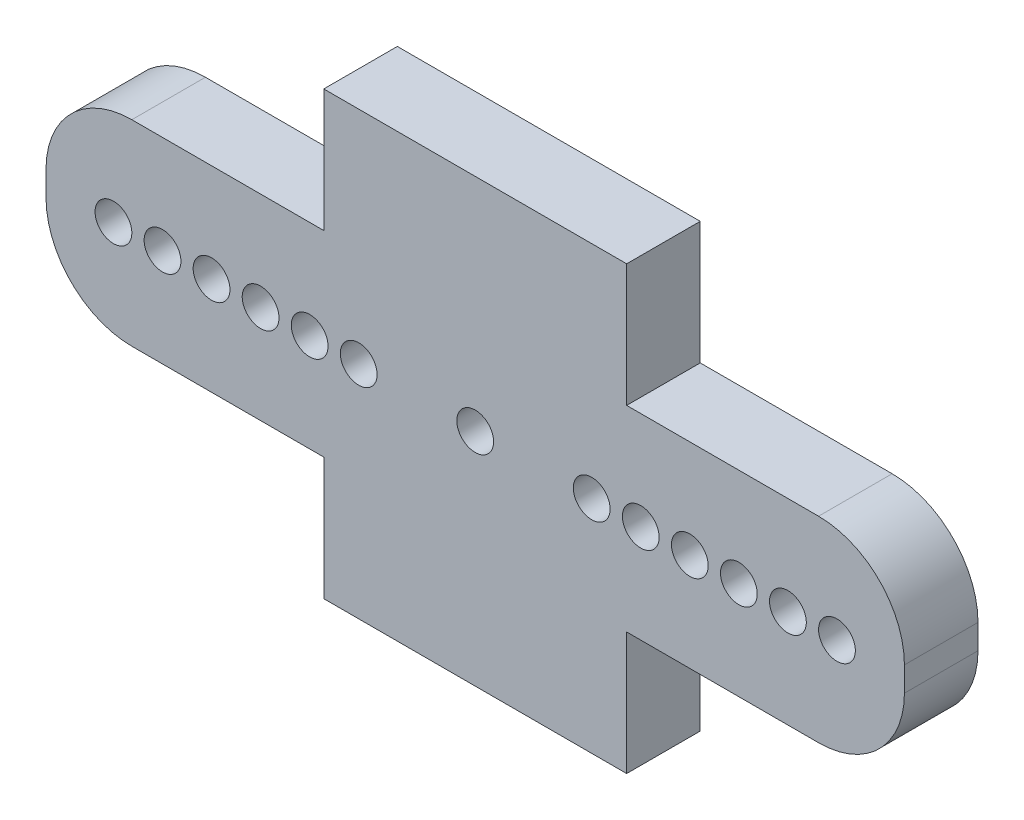
ISO-10303-21;
HEADER;
FILE_DESCRIPTION(('STEP AP214'),'2;1');
FILE_NAME('part.step','',(''),(''),'','','');
FILE_SCHEMA(('AUTOMOTIVE_DESIGN { 1 0 10303 214 1 1 1 1 }'));
ENDSEC;
DATA;
#1=APPLICATION_CONTEXT('core data for automotive mechanical design processes');
#2=APPLICATION_PROTOCOL_DEFINITION('international standard','automotive_design',2000,#1);
#3=PRODUCT_CONTEXT('',#1,'mechanical');
#4=PRODUCT('Part','Part','',(#3));
#5=PRODUCT_RELATED_PRODUCT_CATEGORY('part','',(#4));
#6=PRODUCT_DEFINITION_FORMATION('','',#4);
#7=PRODUCT_DEFINITION_CONTEXT('part definition',#1,'design');
#8=PRODUCT_DEFINITION('design','',#6,#7);
#9=PRODUCT_DEFINITION_SHAPE('','',#8);
#10=(LENGTH_UNIT() NAMED_UNIT(*) SI_UNIT(.MILLI.,.METRE.));
#11=(NAMED_UNIT(*) PLANE_ANGLE_UNIT() SI_UNIT($,.RADIAN.));
#12=(NAMED_UNIT(*) SI_UNIT($,.STERADIAN.) SOLID_ANGLE_UNIT());
#13=UNCERTAINTY_MEASURE_WITH_UNIT(LENGTH_MEASURE(1.E-05),#10,'distance_accuracy_value','');
#14=(GEOMETRIC_REPRESENTATION_CONTEXT(3) GLOBAL_UNCERTAINTY_ASSIGNED_CONTEXT((#13)) GLOBAL_UNIT_ASSIGNED_CONTEXT((#10,
#11,#12)) REPRESENTATION_CONTEXT('',''));
#15=CARTESIAN_POINT('',(0.,0.,0.));
#16=DIRECTION('',(0.,0.,1.));
#17=DIRECTION('',(1.,0.,0.));
#18=AXIS2_PLACEMENT_3D('',#15,#16,#17);
#19=CARTESIAN_POINT('',(-14.,-0.500000000000002,1.5));
#20=DIRECTION('',(0.,0.,-1.));
#21=DIRECTION('',(-1.,0.,0.));
#22=AXIS2_PLACEMENT_3D('',#19,#20,#21);
#23=PLANE('',#22);
#24=CARTESIAN_POINT('',(14.75,0.,1.5));
#25=DIRECTION('',(0.,0.,-1.));
#26=DIRECTION('',(-1.,0.,0.));
#27=AXIS2_PLACEMENT_3D('',#24,#25,#26);
#28=CIRCLE('',#27,0.75);
#29=CARTESIAN_POINT('',(14.,0.,1.5));
#30=VERTEX_POINT('',#29);
#31=EDGE_CURVE('E373',#30,#30,#28,.T.);
#32=ORIENTED_EDGE('',*,*,#31,.T.);
#33=EDGE_LOOP('',(#32));
#34=FACE_BOUND('',#33,.T.);
#35=CARTESIAN_POINT('',(12.75,0.,1.5));
#36=DIRECTION('',(0.,0.,-1.));
#37=DIRECTION('',(-1.,0.,0.));
#38=AXIS2_PLACEMENT_3D('',#35,#36,#37);
#39=CIRCLE('',#38,0.75);
#40=CARTESIAN_POINT('',(12.,0.,1.5));
#41=VERTEX_POINT('',#40);
#42=EDGE_CURVE('E379',#41,#41,#39,.T.);
#43=ORIENTED_EDGE('',*,*,#42,.T.);
#44=EDGE_LOOP('',(#43));
#45=FACE_BOUND('',#44,.T.);
#46=CARTESIAN_POINT('',(10.75,0.,1.5));
#47=DIRECTION('',(0.,0.,-1.));
#48=DIRECTION('',(-1.,0.,0.));
#49=AXIS2_PLACEMENT_3D('',#46,#47,#48);
#50=CIRCLE('',#49,0.75);
#51=CARTESIAN_POINT('',(10.,0.,1.5));
#52=VERTEX_POINT('',#51);
#53=EDGE_CURVE('E387',#52,#52,#50,.T.);
#54=ORIENTED_EDGE('',*,*,#53,.T.);
#55=EDGE_LOOP('',(#54));
#56=FACE_BOUND('',#55,.T.);
#57=CARTESIAN_POINT('',(8.75000000000001,0.,1.5));
#58=DIRECTION('',(0.,0.,-1.));
#59=DIRECTION('',(-1.,0.,0.));
#60=AXIS2_PLACEMENT_3D('',#57,#58,#59);
#61=CIRCLE('',#60,0.75);
#62=CARTESIAN_POINT('',(8.00000000000001,0.,1.5));
#63=VERTEX_POINT('',#62);
#64=EDGE_CURVE('E393',#63,#63,#61,.T.);
#65=ORIENTED_EDGE('',*,*,#64,.T.);
#66=EDGE_LOOP('',(#65));
#67=FACE_BOUND('',#66,.T.);
#68=CARTESIAN_POINT('',(6.75000000000001,0.,1.5));
#69=DIRECTION('',(0.,0.,-1.));
#70=DIRECTION('',(-1.,0.,0.));
#71=AXIS2_PLACEMENT_3D('',#68,#69,#70);
#72=CIRCLE('',#71,0.75);
#73=CARTESIAN_POINT('',(6.00000000000001,0.,1.5));
#74=VERTEX_POINT('',#73);
#75=EDGE_CURVE('E399',#74,#74,#72,.T.);
#76=ORIENTED_EDGE('',*,*,#75,.T.);
#77=EDGE_LOOP('',(#76));
#78=FACE_BOUND('',#77,.T.);
#79=CARTESIAN_POINT('',(4.75000000000001,0.,1.5));
#80=DIRECTION('',(0.,0.,-1.));
#81=DIRECTION('',(-1.,0.,0.));
#82=AXIS2_PLACEMENT_3D('',#79,#80,#81);
#83=CIRCLE('',#82,0.75);
#84=CARTESIAN_POINT('',(4.00000000000001,0.,1.5));
#85=VERTEX_POINT('',#84);
#86=EDGE_CURVE('E405',#85,#85,#83,.T.);
#87=ORIENTED_EDGE('',*,*,#86,.T.);
#88=EDGE_LOOP('',(#87));
#89=FACE_BOUND('',#88,.T.);
#90=CARTESIAN_POINT('',(-14.75,0.,1.5));
#91=DIRECTION('',(0.,0.,1.));
#92=DIRECTION('',(1.,0.,0.));
#93=AXIS2_PLACEMENT_3D('',#90,#91,#92);
#94=CIRCLE('',#93,0.75);
#95=CARTESIAN_POINT('',(-14.,0.,1.5));
#96=VERTEX_POINT('',#95);
#97=EDGE_CURVE('E412',#96,#96,#94,.T.);
#98=ORIENTED_EDGE('',*,*,#97,.F.);
#99=EDGE_LOOP('',(#98));
#100=FACE_BOUND('',#99,.T.);
#101=CARTESIAN_POINT('',(-12.75,0.,1.5));
#102=DIRECTION('',(0.,0.,1.));
#103=DIRECTION('',(1.,0.,0.));
#104=AXIS2_PLACEMENT_3D('',#101,#102,#103);
#105=CIRCLE('',#104,0.75);
#106=CARTESIAN_POINT('',(-12.,0.,1.5));
#107=VERTEX_POINT('',#106);
#108=EDGE_CURVE('E418',#107,#107,#105,.T.);
#109=ORIENTED_EDGE('',*,*,#108,.F.);
#110=EDGE_LOOP('',(#109));
#111=FACE_BOUND('',#110,.T.);
#112=CARTESIAN_POINT('',(-10.75,0.,1.5));
#113=DIRECTION('',(0.,0.,1.));
#114=DIRECTION('',(1.,0.,0.));
#115=AXIS2_PLACEMENT_3D('',#112,#113,#114);
#116=CIRCLE('',#115,0.75);
#117=CARTESIAN_POINT('',(-10.,0.,1.5));
#118=VERTEX_POINT('',#117);
#119=EDGE_CURVE('E424',#118,#118,#116,.T.);
#120=ORIENTED_EDGE('',*,*,#119,.F.);
#121=EDGE_LOOP('',(#120));
#122=FACE_BOUND('',#121,.T.);
#123=CARTESIAN_POINT('',(-8.75000000000001,0.,1.5));
#124=DIRECTION('',(0.,0.,1.));
#125=DIRECTION('',(1.,0.,0.));
#126=AXIS2_PLACEMENT_3D('',#123,#124,#125);
#127=CIRCLE('',#126,0.75);
#128=CARTESIAN_POINT('',(-8.00000000000001,0.,1.5));
#129=VERTEX_POINT('',#128);
#130=EDGE_CURVE('E430',#129,#129,#127,.T.);
#131=ORIENTED_EDGE('',*,*,#130,.F.);
#132=EDGE_LOOP('',(#131));
#133=FACE_BOUND('',#132,.T.);
#134=CARTESIAN_POINT('',(-6.75000000000001,0.,1.5));
#135=DIRECTION('',(0.,0.,1.));
#136=DIRECTION('',(1.,0.,0.));
#137=AXIS2_PLACEMENT_3D('',#134,#135,#136);
#138=CIRCLE('',#137,0.75);
#139=CARTESIAN_POINT('',(-6.00000000000001,0.,1.5));
#140=VERTEX_POINT('',#139);
#141=EDGE_CURVE('E436',#140,#140,#138,.T.);
#142=ORIENTED_EDGE('',*,*,#141,.F.);
#143=EDGE_LOOP('',(#142));
#144=FACE_BOUND('',#143,.T.);
#145=CARTESIAN_POINT('',(-4.75000000000001,0.,1.5));
#146=DIRECTION('',(0.,0.,1.));
#147=DIRECTION('',(1.,0.,0.));
#148=AXIS2_PLACEMENT_3D('',#145,#146,#147);
#149=CIRCLE('',#148,0.75);
#150=CARTESIAN_POINT('',(-4.00000000000001,0.,1.5));
#151=VERTEX_POINT('',#150);
#152=EDGE_CURVE('E376',#151,#151,#149,.T.);
#153=ORIENTED_EDGE('',*,*,#152,.F.);
#154=EDGE_LOOP('',(#153));
#155=FACE_BOUND('',#154,.T.);
#156=DIRECTION('',(1.,0.,0.));
#157=VECTOR('',#156,1.);
#158=CARTESIAN_POINT('',(6.17499999999999,-9.,1.5));
#159=LINE('',#158,#157);
#160=CARTESIAN_POINT('',(-6.17500000000001,-9.,1.5));
#161=VERTEX_POINT('',#160);
#162=CARTESIAN_POINT('',(6.17499999999999,-9.,1.5));
#163=VERTEX_POINT('',#162);
#164=EDGE_CURVE('E209',#161,#163,#159,.T.);
#165=ORIENTED_EDGE('',*,*,#164,.T.);
#166=DIRECTION('',(0.,1.,0.));
#167=VECTOR('',#166,1.);
#168=CARTESIAN_POINT('',(6.17499999999999,-4.,1.5));
#169=LINE('',#168,#167);
#170=CARTESIAN_POINT('',(6.17499999999999,-4.,1.5));
#171=VERTEX_POINT('',#170);
#172=EDGE_CURVE('E117',#163,#171,#169,.T.);
#173=ORIENTED_EDGE('',*,*,#172,.T.);
#174=DIRECTION('',(1.,0.,0.));
#175=VECTOR('',#174,1.);
#176=CARTESIAN_POINT('',(14.,-4.,1.5));
#177=LINE('',#176,#175);
#178=CARTESIAN_POINT('',(14.,-4.,1.5));
#179=VERTEX_POINT('',#178);
#180=EDGE_CURVE('E248',#171,#179,#177,.T.);
#181=ORIENTED_EDGE('',*,*,#180,.T.);
#182=CARTESIAN_POINT('',(14.,-0.500000000000002,1.5));
#183=DIRECTION('',(0.,0.,1.));
#184=DIRECTION('',(-1.,0.,0.));
#185=AXIS2_PLACEMENT_3D('',#182,#183,#184);
#186=CIRCLE('',#185,3.5);
#187=CARTESIAN_POINT('',(17.5,-0.499999999999976,1.5));
#188=VERTEX_POINT('',#187);
#189=EDGE_CURVE('E267',#179,#188,#186,.T.);
#190=ORIENTED_EDGE('',*,*,#189,.T.);
#191=DIRECTION('',(0.,1.,0.));
#192=VECTOR('',#191,1.);
#193=CARTESIAN_POINT('',(17.5,0.499999999999974,1.5));
#194=LINE('',#193,#192);
#195=CARTESIAN_POINT('',(17.5,0.499999999999974,1.5));
#196=VERTEX_POINT('',#195);
#197=EDGE_CURVE('E264',#188,#196,#194,.T.);
#198=ORIENTED_EDGE('',*,*,#197,.T.);
#199=CARTESIAN_POINT('',(14.,0.499999999999998,1.5));
#200=DIRECTION('',(0.,0.,1.));
#201=DIRECTION('',(-1.,0.,0.));
#202=AXIS2_PLACEMENT_3D('',#199,#200,#201);
#203=CIRCLE('',#202,3.5);
#204=CARTESIAN_POINT('',(14.,4.,1.5));
#205=VERTEX_POINT('',#204);
#206=EDGE_CURVE('E266',#196,#205,#203,.T.);
#207=ORIENTED_EDGE('',*,*,#206,.T.);
#208=DIRECTION('',(-1.,0.,0.));
#209=VECTOR('',#208,1.);
#210=CARTESIAN_POINT('',(6.17499999999999,4.,1.5));
#211=LINE('',#210,#209);
#212=CARTESIAN_POINT('',(6.17499999999999,4.,1.5));
#213=VERTEX_POINT('',#212);
#214=EDGE_CURVE('E269',#205,#213,#211,.T.);
#215=ORIENTED_EDGE('',*,*,#214,.T.);
#216=DIRECTION('',(0.,1.,0.));
#217=VECTOR('',#216,1.);
#218=CARTESIAN_POINT('',(6.17499999999999,9.,1.5));
#219=LINE('',#218,#217);
#220=CARTESIAN_POINT('',(6.17499999999999,9.,1.5));
#221=VERTEX_POINT('',#220);
#222=EDGE_CURVE('E275',#213,#221,#219,.T.);
#223=ORIENTED_EDGE('',*,*,#222,.T.);
#224=DIRECTION('',(-1.,0.,0.));
#225=VECTOR('',#224,1.);
#226=CARTESIAN_POINT('',(-6.17500000000001,9.,1.5));
#227=LINE('',#226,#225);
#228=CARTESIAN_POINT('',(-6.17500000000001,9.,1.5));
#229=VERTEX_POINT('',#228);
#230=EDGE_CURVE('E277',#221,#229,#227,.T.);
#231=ORIENTED_EDGE('',*,*,#230,.T.);
#232=DIRECTION('',(0.,-1.,0.));
#233=VECTOR('',#232,1.);
#234=CARTESIAN_POINT('',(-6.17500000000001,4.,1.5));
#235=LINE('',#234,#233);
#236=CARTESIAN_POINT('',(-6.17500000000001,4.,1.5));
#237=VERTEX_POINT('',#236);
#238=EDGE_CURVE('E279',#229,#237,#235,.T.);
#239=ORIENTED_EDGE('',*,*,#238,.T.);
#240=DIRECTION('',(-1.,0.,0.));
#241=VECTOR('',#240,1.);
#242=CARTESIAN_POINT('',(-14.,4.,1.5));
#243=LINE('',#242,#241);
#244=CARTESIAN_POINT('',(-14.,4.,1.5));
#245=VERTEX_POINT('',#244);
#246=EDGE_CURVE('E281',#237,#245,#243,.T.);
#247=ORIENTED_EDGE('',*,*,#246,.T.);
#248=CARTESIAN_POINT('',(-14.,0.499999999999999,1.5));
#249=DIRECTION('',(0.,0.,1.));
#250=DIRECTION('',(1.,0.,0.));
#251=AXIS2_PLACEMENT_3D('',#248,#249,#250);
#252=CIRCLE('',#251,3.5);
#253=CARTESIAN_POINT('',(-17.5,0.499999999999974,1.5));
#254=VERTEX_POINT('',#253);
#255=EDGE_CURVE('E283',#245,#254,#252,.T.);
#256=ORIENTED_EDGE('',*,*,#255,.T.);
#257=DIRECTION('',(0.,-1.,0.));
#258=VECTOR('',#257,1.);
#259=CARTESIAN_POINT('',(-17.5,-0.499999999999977,1.5));
#260=LINE('',#259,#258);
#261=CARTESIAN_POINT('',(-17.5,-0.499999999999977,1.5));
#262=VERTEX_POINT('',#261);
#263=EDGE_CURVE('E160',#254,#262,#260,.T.);
#264=ORIENTED_EDGE('',*,*,#263,.T.);
#265=CARTESIAN_POINT('',(-14.,-0.500000000000002,1.5));
#266=DIRECTION('',(0.,0.,1.));
#267=DIRECTION('',(-1.,0.,0.));
#268=AXIS2_PLACEMENT_3D('',#265,#266,#267);
#269=CIRCLE('',#268,3.5);
#270=CARTESIAN_POINT('',(-14.,-4.,1.5));
#271=VERTEX_POINT('',#270);
#272=EDGE_CURVE('E154',#262,#271,#269,.T.);
#273=ORIENTED_EDGE('',*,*,#272,.T.);
#274=DIRECTION('',(1.,0.,0.));
#275=VECTOR('',#274,1.);
#276=CARTESIAN_POINT('',(-6.17500000000001,-4.,1.5));
#277=LINE('',#276,#275);
#278=CARTESIAN_POINT('',(-6.17500000000001,-4.,1.5));
#279=VERTEX_POINT('',#278);
#280=EDGE_CURVE('E158',#271,#279,#277,.T.);
#281=ORIENTED_EDGE('',*,*,#280,.T.);
#282=DIRECTION('',(0.,-1.,0.));
#283=VECTOR('',#282,1.);
#284=CARTESIAN_POINT('',(-6.17500000000001,-9.,1.5));
#285=LINE('',#284,#283);
#286=EDGE_CURVE('E50',#279,#161,#285,.T.);
#287=ORIENTED_EDGE('',*,*,#286,.T.);
#288=EDGE_LOOP('',(#165,#173,#181,#190,#198,#207,#215,#223,#231,#239,#247,#256,#264,#273,#281,#287));
#289=FACE_BOUND('',#288,.T.);
#290=CARTESIAN_POINT('',(0.,0.,1.5));
#291=DIRECTION('',(0.,0.,1.));
#292=DIRECTION('',(1.,0.,0.));
#293=AXIS2_PLACEMENT_3D('',#290,#291,#292);
#294=CIRCLE('',#293,0.75);
#295=CARTESIAN_POINT('',(0.749999999999993,0.,1.5));
#296=VERTEX_POINT('',#295);
#297=EDGE_CURVE('E182',#296,#296,#294,.T.);
#298=ORIENTED_EDGE('',*,*,#297,.F.);
#299=EDGE_LOOP('',(#298));
#300=FACE_BOUND('',#299,.T.);
#301=ADVANCED_FACE('F33',(#34,#45,#56,#67,#78,#89,#100,#111,#122,#133,#144,#155,#289,#300),#23,.F.);
#302=CARTESIAN_POINT('',(-14.,-0.500000000000002,-1.5));
#303=DIRECTION('',(0.,0.,-1.));
#304=DIRECTION('',(-1.,0.,0.));
#305=AXIS2_PLACEMENT_3D('',#302,#303,#304);
#306=PLANE('',#305);
#307=CARTESIAN_POINT('',(14.75,0.,-1.5));
#308=DIRECTION('',(0.,0.,-1.));
#309=DIRECTION('',(-1.,0.,0.));
#310=AXIS2_PLACEMENT_3D('',#307,#308,#309);
#311=CIRCLE('',#310,0.75);
#312=CARTESIAN_POINT('',(14.,0.,-1.5));
#313=VERTEX_POINT('',#312);
#314=EDGE_CURVE('E371',#313,#313,#311,.T.);
#315=ORIENTED_EDGE('',*,*,#314,.F.);
#316=EDGE_LOOP('',(#315));
#317=FACE_BOUND('',#316,.T.);
#318=CARTESIAN_POINT('',(12.75,0.,-1.5));
#319=DIRECTION('',(0.,0.,-1.));
#320=DIRECTION('',(-1.,0.,0.));
#321=AXIS2_PLACEMENT_3D('',#318,#319,#320);
#322=CIRCLE('',#321,0.75);
#323=CARTESIAN_POINT('',(12.,0.,-1.5));
#324=VERTEX_POINT('',#323);
#325=EDGE_CURVE('E374',#324,#324,#322,.T.);
#326=ORIENTED_EDGE('',*,*,#325,.F.);
#327=EDGE_LOOP('',(#326));
#328=FACE_BOUND('',#327,.T.);
#329=CARTESIAN_POINT('',(10.75,0.,-1.5));
#330=DIRECTION('',(0.,0.,-1.));
#331=DIRECTION('',(-1.,0.,0.));
#332=AXIS2_PLACEMENT_3D('',#329,#330,#331);
#333=CIRCLE('',#332,0.75);
#334=CARTESIAN_POINT('',(10.,0.,-1.5));
#335=VERTEX_POINT('',#334);
#336=EDGE_CURVE('E384',#335,#335,#333,.T.);
#337=ORIENTED_EDGE('',*,*,#336,.F.);
#338=EDGE_LOOP('',(#337));
#339=FACE_BOUND('',#338,.T.);
#340=CARTESIAN_POINT('',(8.75000000000001,0.,-1.5));
#341=DIRECTION('',(0.,0.,-1.));
#342=DIRECTION('',(-1.,0.,0.));
#343=AXIS2_PLACEMENT_3D('',#340,#341,#342);
#344=CIRCLE('',#343,0.75);
#345=CARTESIAN_POINT('',(8.00000000000001,0.,-1.5));
#346=VERTEX_POINT('',#345);
#347=EDGE_CURVE('E390',#346,#346,#344,.T.);
#348=ORIENTED_EDGE('',*,*,#347,.F.);
#349=EDGE_LOOP('',(#348));
#350=FACE_BOUND('',#349,.T.);
#351=CARTESIAN_POINT('',(6.75000000000001,0.,-1.5));
#352=DIRECTION('',(0.,0.,-1.));
#353=DIRECTION('',(-1.,0.,0.));
#354=AXIS2_PLACEMENT_3D('',#351,#352,#353);
#355=CIRCLE('',#354,0.75);
#356=CARTESIAN_POINT('',(6.00000000000001,0.,-1.5));
#357=VERTEX_POINT('',#356);
#358=EDGE_CURVE('E396',#357,#357,#355,.T.);
#359=ORIENTED_EDGE('',*,*,#358,.F.);
#360=EDGE_LOOP('',(#359));
#361=FACE_BOUND('',#360,.T.);
#362=CARTESIAN_POINT('',(4.75000000000001,0.,-1.5));
#363=DIRECTION('',(0.,0.,-1.));
#364=DIRECTION('',(-1.,0.,0.));
#365=AXIS2_PLACEMENT_3D('',#362,#363,#364);
#366=CIRCLE('',#365,0.75);
#367=CARTESIAN_POINT('',(4.00000000000001,0.,-1.5));
#368=VERTEX_POINT('',#367);
#369=EDGE_CURVE('E402',#368,#368,#366,.T.);
#370=ORIENTED_EDGE('',*,*,#369,.F.);
#371=EDGE_LOOP('',(#370));
#372=FACE_BOUND('',#371,.T.);
#373=CARTESIAN_POINT('',(-14.75,0.,-1.5));
#374=DIRECTION('',(0.,0.,1.));
#375=DIRECTION('',(1.,0.,0.));
#376=AXIS2_PLACEMENT_3D('',#373,#374,#375);
#377=CIRCLE('',#376,0.75);
#378=CARTESIAN_POINT('',(-14.,0.,-1.5));
#379=VERTEX_POINT('',#378);
#380=EDGE_CURVE('E408',#379,#379,#377,.T.);
#381=ORIENTED_EDGE('',*,*,#380,.T.);
#382=EDGE_LOOP('',(#381));
#383=FACE_BOUND('',#382,.T.);
#384=CARTESIAN_POINT('',(-12.75,0.,-1.5));
#385=DIRECTION('',(0.,0.,1.));
#386=DIRECTION('',(1.,0.,0.));
#387=AXIS2_PLACEMENT_3D('',#384,#385,#386);
#388=CIRCLE('',#387,0.75);
#389=CARTESIAN_POINT('',(-12.,0.,-1.5));
#390=VERTEX_POINT('',#389);
#391=EDGE_CURVE('E415',#390,#390,#388,.T.);
#392=ORIENTED_EDGE('',*,*,#391,.T.);
#393=EDGE_LOOP('',(#392));
#394=FACE_BOUND('',#393,.T.);
#395=CARTESIAN_POINT('',(-10.75,0.,-1.5));
#396=DIRECTION('',(0.,0.,1.));
#397=DIRECTION('',(1.,0.,0.));
#398=AXIS2_PLACEMENT_3D('',#395,#396,#397);
#399=CIRCLE('',#398,0.75);
#400=CARTESIAN_POINT('',(-10.,0.,-1.5));
#401=VERTEX_POINT('',#400);
#402=EDGE_CURVE('E421',#401,#401,#399,.T.);
#403=ORIENTED_EDGE('',*,*,#402,.T.);
#404=EDGE_LOOP('',(#403));
#405=FACE_BOUND('',#404,.T.);
#406=CARTESIAN_POINT('',(-8.75000000000001,0.,-1.5));
#407=DIRECTION('',(0.,0.,1.));
#408=DIRECTION('',(1.,0.,0.));
#409=AXIS2_PLACEMENT_3D('',#406,#407,#408);
#410=CIRCLE('',#409,0.75);
#411=CARTESIAN_POINT('',(-8.00000000000001,0.,-1.5));
#412=VERTEX_POINT('',#411);
#413=EDGE_CURVE('E427',#412,#412,#410,.T.);
#414=ORIENTED_EDGE('',*,*,#413,.T.);
#415=EDGE_LOOP('',(#414));
#416=FACE_BOUND('',#415,.T.);
#417=CARTESIAN_POINT('',(-6.75000000000001,0.,-1.5));
#418=DIRECTION('',(0.,0.,1.));
#419=DIRECTION('',(1.,0.,0.));
#420=AXIS2_PLACEMENT_3D('',#417,#418,#419);
#421=CIRCLE('',#420,0.75);
#422=CARTESIAN_POINT('',(-6.00000000000001,0.,-1.5));
#423=VERTEX_POINT('',#422);
#424=EDGE_CURVE('E433',#423,#423,#421,.T.);
#425=ORIENTED_EDGE('',*,*,#424,.T.);
#426=EDGE_LOOP('',(#425));
#427=FACE_BOUND('',#426,.T.);
#428=CARTESIAN_POINT('',(-4.75000000000001,0.,-1.5));
#429=DIRECTION('',(0.,0.,1.));
#430=DIRECTION('',(1.,0.,0.));
#431=AXIS2_PLACEMENT_3D('',#428,#429,#430);
#432=CIRCLE('',#431,0.75);
#433=CARTESIAN_POINT('',(-4.00000000000001,0.,-1.5));
#434=VERTEX_POINT('',#433);
#435=EDGE_CURVE('E439',#434,#434,#432,.T.);
#436=ORIENTED_EDGE('',*,*,#435,.T.);
#437=EDGE_LOOP('',(#436));
#438=FACE_BOUND('',#437,.T.);
#439=DIRECTION('',(1.,0.,0.));
#440=VECTOR('',#439,1.);
#441=CARTESIAN_POINT('',(6.17499999999999,-9.,-1.5));
#442=LINE('',#441,#440);
#443=CARTESIAN_POINT('',(-6.17500000000001,-9.,-1.5));
#444=VERTEX_POINT('',#443);
#445=CARTESIAN_POINT('',(6.17499999999999,-9.,-1.5));
#446=VERTEX_POINT('',#445);
#447=EDGE_CURVE('E178',#444,#446,#442,.T.);
#448=ORIENTED_EDGE('',*,*,#447,.F.);
#449=DIRECTION('',(0.,-1.,0.));
#450=VECTOR('',#449,1.);
#451=CARTESIAN_POINT('',(-6.17500000000001,-9.,-1.5));
#452=LINE('',#451,#450);
#453=CARTESIAN_POINT('',(-6.17500000000001,-4.,-1.5));
#454=VERTEX_POINT('',#453);
#455=EDGE_CURVE('E109',#454,#444,#452,.T.);
#456=ORIENTED_EDGE('',*,*,#455,.F.);
#457=DIRECTION('',(1.,0.,0.));
#458=VECTOR('',#457,1.);
#459=CARTESIAN_POINT('',(-6.17500000000001,-4.,-1.5));
#460=LINE('',#459,#458);
#461=CARTESIAN_POINT('',(-14.,-4.,-1.5));
#462=VERTEX_POINT('',#461);
#463=EDGE_CURVE('E103',#462,#454,#460,.T.);
#464=ORIENTED_EDGE('',*,*,#463,.F.);
#465=CARTESIAN_POINT('',(-14.,-0.500000000000002,-1.5));
#466=DIRECTION('',(0.,0.,1.));
#467=DIRECTION('',(-1.,0.,0.));
#468=AXIS2_PLACEMENT_3D('',#465,#466,#467);
#469=CIRCLE('',#468,3.5);
#470=CARTESIAN_POINT('',(-17.5,-0.499999999999977,-1.5));
#471=VERTEX_POINT('',#470);
#472=EDGE_CURVE('E168',#471,#462,#469,.T.);
#473=ORIENTED_EDGE('',*,*,#472,.F.);
#474=DIRECTION('',(0.,-1.,0.));
#475=VECTOR('',#474,1.);
#476=CARTESIAN_POINT('',(-17.5,-0.499999999999977,-1.5));
#477=LINE('',#476,#475);
#478=CARTESIAN_POINT('',(-17.5,0.499999999999974,-1.5));
#479=VERTEX_POINT('',#478);
#480=EDGE_CURVE('E204',#479,#471,#477,.T.);
#481=ORIENTED_EDGE('',*,*,#480,.F.);
#482=CARTESIAN_POINT('',(-14.,0.499999999999999,-1.5));
#483=DIRECTION('',(0.,0.,1.));
#484=DIRECTION('',(1.,0.,0.));
#485=AXIS2_PLACEMENT_3D('',#482,#483,#484);
#486=CIRCLE('',#485,3.5);
#487=CARTESIAN_POINT('',(-14.,4.,-1.5));
#488=VERTEX_POINT('',#487);
#489=EDGE_CURVE('E202',#488,#479,#486,.T.);
#490=ORIENTED_EDGE('',*,*,#489,.F.);
#491=DIRECTION('',(-1.,0.,0.));
#492=VECTOR('',#491,1.);
#493=CARTESIAN_POINT('',(-14.,4.,-1.5));
#494=LINE('',#493,#492);
#495=CARTESIAN_POINT('',(-6.17500000000001,4.,-1.5));
#496=VERTEX_POINT('',#495);
#497=EDGE_CURVE('E200',#496,#488,#494,.T.);
#498=ORIENTED_EDGE('',*,*,#497,.F.);
#499=DIRECTION('',(0.,-1.,0.));
#500=VECTOR('',#499,1.);
#501=CARTESIAN_POINT('',(-6.17500000000001,4.,-1.5));
#502=LINE('',#501,#500);
#503=CARTESIAN_POINT('',(-6.17500000000001,9.,-1.5));
#504=VERTEX_POINT('',#503);
#505=EDGE_CURVE('E198',#504,#496,#502,.T.);
#506=ORIENTED_EDGE('',*,*,#505,.F.);
#507=DIRECTION('',(-1.,0.,0.));
#508=VECTOR('',#507,1.);
#509=CARTESIAN_POINT('',(-6.17500000000001,9.,-1.5));
#510=LINE('',#509,#508);
#511=CARTESIAN_POINT('',(6.17499999999999,9.,-1.5));
#512=VERTEX_POINT('',#511);
#513=EDGE_CURVE('E196',#512,#504,#510,.T.);
#514=ORIENTED_EDGE('',*,*,#513,.F.);
#515=DIRECTION('',(0.,1.,0.));
#516=VECTOR('',#515,1.);
#517=CARTESIAN_POINT('',(6.17499999999999,9.,-1.5));
#518=LINE('',#517,#516);
#519=CARTESIAN_POINT('',(6.17499999999999,4.,-1.5));
#520=VERTEX_POINT('',#519);
#521=EDGE_CURVE('E194',#520,#512,#518,.T.);
#522=ORIENTED_EDGE('',*,*,#521,.F.);
#523=DIRECTION('',(-1.,0.,0.));
#524=VECTOR('',#523,1.);
#525=CARTESIAN_POINT('',(6.17499999999999,4.,-1.5));
#526=LINE('',#525,#524);
#527=CARTESIAN_POINT('',(14.,4.,-1.5));
#528=VERTEX_POINT('',#527);
#529=EDGE_CURVE('E192',#528,#520,#526,.T.);
#530=ORIENTED_EDGE('',*,*,#529,.F.);
#531=CARTESIAN_POINT('',(14.,0.499999999999998,-1.5));
#532=DIRECTION('',(0.,0.,1.));
#533=DIRECTION('',(-1.,0.,0.));
#534=AXIS2_PLACEMENT_3D('',#531,#532,#533);
#535=CIRCLE('',#534,3.5);
#536=CARTESIAN_POINT('',(17.5,0.499999999999974,-1.5));
#537=VERTEX_POINT('',#536);
#538=EDGE_CURVE('E190',#537,#528,#535,.T.);
#539=ORIENTED_EDGE('',*,*,#538,.F.);
#540=DIRECTION('',(0.,1.,0.));
#541=VECTOR('',#540,1.);
#542=CARTESIAN_POINT('',(17.5,0.499999999999974,-1.5));
#543=LINE('',#542,#541);
#544=CARTESIAN_POINT('',(17.5,-0.499999999999976,-1.5));
#545=VERTEX_POINT('',#544);
#546=EDGE_CURVE('E188',#545,#537,#543,.T.);
#547=ORIENTED_EDGE('',*,*,#546,.F.);
#548=CARTESIAN_POINT('',(14.,-0.500000000000002,-1.5));
#549=DIRECTION('',(0.,0.,1.));
#550=DIRECTION('',(-1.,0.,0.));
#551=AXIS2_PLACEMENT_3D('',#548,#549,#550);
#552=CIRCLE('',#551,3.5);
#553=CARTESIAN_POINT('',(14.,-4.,-1.5));
#554=VERTEX_POINT('',#553);
#555=EDGE_CURVE('E186',#554,#545,#552,.T.);
#556=ORIENTED_EDGE('',*,*,#555,.F.);
#557=DIRECTION('',(1.,0.,0.));
#558=VECTOR('',#557,1.);
#559=CARTESIAN_POINT('',(14.,-4.,-1.5));
#560=LINE('',#559,#558);
#561=CARTESIAN_POINT('',(6.17499999999999,-4.,-1.5));
#562=VERTEX_POINT('',#561);
#563=EDGE_CURVE('E184',#562,#554,#560,.T.);
#564=ORIENTED_EDGE('',*,*,#563,.F.);
#565=DIRECTION('',(0.,1.,0.));
#566=VECTOR('',#565,1.);
#567=CARTESIAN_POINT('',(6.17499999999999,-4.,-1.5));
#568=LINE('',#567,#566);
#569=EDGE_CURVE('E181',#446,#562,#568,.T.);
#570=ORIENTED_EDGE('',*,*,#569,.F.);
#571=EDGE_LOOP('',(#448,#456,#464,#473,#481,#490,#498,#506,#514,#522,#530,#539,#547,#556,#564,#570));
#572=FACE_BOUND('',#571,.T.);
#573=CARTESIAN_POINT('',(0.,0.,-1.5));
#574=DIRECTION('',(0.,0.,1.));
#575=DIRECTION('',(1.,0.,0.));
#576=AXIS2_PLACEMENT_3D('',#573,#574,#575);
#577=CIRCLE('',#576,0.75);
#578=CARTESIAN_POINT('',(0.749999999999993,0.,-1.5));
#579=VERTEX_POINT('',#578);
#580=EDGE_CURVE('E411',#579,#579,#577,.T.);
#581=ORIENTED_EDGE('',*,*,#580,.T.);
#582=EDGE_LOOP('',(#581));
#583=FACE_BOUND('',#582,.T.);
#584=ADVANCED_FACE('F252',(#317,#328,#339,#350,#361,#372,#383,#394,#405,#416,#427,#438,#572,
#583),#306,.T.);
#585=CARTESIAN_POINT('',(6.17499999999999,-9.,1.5));
#586=DIRECTION('',(0.,1.,0.));
#587=DIRECTION('',(0.,0.,1.));
#588=AXIS2_PLACEMENT_3D('',#585,#586,#587);
#589=PLANE('',#588);
#590=ORIENTED_EDGE('',*,*,#447,.T.);
#591=DIRECTION('',(0.,0.,-1.));
#592=VECTOR('',#591,1.);
#593=CARTESIAN_POINT('',(6.17499999999999,-9.,1.5));
#594=LINE('',#593,#592);
#595=EDGE_CURVE('E11',#163,#446,#594,.T.);
#596=ORIENTED_EDGE('',*,*,#595,.F.);
#597=ORIENTED_EDGE('',*,*,#164,.F.);
#598=DIRECTION('',(0.,0.,-1.));
#599=VECTOR('',#598,1.);
#600=CARTESIAN_POINT('',(-6.17500000000001,-9.,1.5));
#601=LINE('',#600,#599);
#602=EDGE_CURVE('E174',#161,#444,#601,.T.);
#603=ORIENTED_EDGE('',*,*,#602,.T.);
#604=EDGE_LOOP('',(#590,#596,#597,#603));
#605=FACE_BOUND('',#604,.T.);
#606=ADVANCED_FACE('F35',(#605),#589,.F.);
#607=CARTESIAN_POINT('',(6.17499999999999,-4.,1.5));
#608=DIRECTION('',(-1.,0.,0.));
#609=DIRECTION('',(0.,-1.,0.));
#610=AXIS2_PLACEMENT_3D('',#607,#608,#609);
#611=PLANE('',#610);
#612=ORIENTED_EDGE('',*,*,#569,.T.);
#613=DIRECTION('',(0.,0.,-1.));
#614=VECTOR('',#613,1.);
#615=CARTESIAN_POINT('',(6.17499999999999,-4.,1.5));
#616=LINE('',#615,#614);
#617=EDGE_CURVE('E42',#171,#562,#616,.T.);
#618=ORIENTED_EDGE('',*,*,#617,.F.);
#619=ORIENTED_EDGE('',*,*,#172,.F.);
#620=ORIENTED_EDGE('',*,*,#595,.T.);
#621=EDGE_LOOP('',(#612,#618,#619,#620));
#622=FACE_BOUND('',#621,.T.);
#623=ADVANCED_FACE('F674',(#622),#611,.F.);
#624=CARTESIAN_POINT('',(14.,-4.,1.5));
#625=DIRECTION('',(0.,1.,0.));
#626=DIRECTION('',(0.,0.,1.));
#627=AXIS2_PLACEMENT_3D('',#624,#625,#626);
#628=PLANE('',#627);
#629=ORIENTED_EDGE('',*,*,#563,.T.);
#630=DIRECTION('',(0.,0.,-1.));
#631=VECTOR('',#630,1.);
#632=CARTESIAN_POINT('',(14.,-4.,1.5));
#633=LINE('',#632,#631);
#634=EDGE_CURVE('E240',#179,#554,#633,.T.);
#635=ORIENTED_EDGE('',*,*,#634,.F.);
#636=ORIENTED_EDGE('',*,*,#180,.F.);
#637=ORIENTED_EDGE('',*,*,#617,.T.);
#638=EDGE_LOOP('',(#629,#635,#636,#637));
#639=FACE_BOUND('',#638,.T.);
#640=ADVANCED_FACE('F246',(#639),#628,.F.);
#641=CARTESIAN_POINT('',(14.,-0.500000000000002,1.5));
#642=DIRECTION('',(0.,0.,-1.));
#643=DIRECTION('',(-1.,0.,0.));
#644=AXIS2_PLACEMENT_3D('',#641,#642,#643);
#645=CYLINDRICAL_SURFACE('',#644,3.5);
#646=ORIENTED_EDGE('',*,*,#555,.T.);
#647=DIRECTION('',(0.,0.,-1.));
#648=VECTOR('',#647,1.);
#649=CARTESIAN_POINT('',(17.5,-0.499999999999976,1.5));
#650=LINE('',#649,#648);
#651=EDGE_CURVE('E237',#188,#545,#650,.T.);
#652=ORIENTED_EDGE('',*,*,#651,.F.);
#653=ORIENTED_EDGE('',*,*,#189,.F.);
#654=ORIENTED_EDGE('',*,*,#634,.T.);
#655=EDGE_LOOP('',(#646,#652,#653,#654));
#656=FACE_BOUND('',#655,.T.);
#657=ADVANCED_FACE('F258',(#656),#645,.T.);
#658=CARTESIAN_POINT('',(17.5,0.499999999999974,1.5));
#659=DIRECTION('',(-1.,0.,0.));
#660=DIRECTION('',(0.,0.,1.));
#661=AXIS2_PLACEMENT_3D('',#658,#659,#660);
#662=PLANE('',#661);
#663=ORIENTED_EDGE('',*,*,#546,.T.);
#664=DIRECTION('',(0.,0.,-1.));
#665=VECTOR('',#664,1.);
#666=CARTESIAN_POINT('',(17.5,0.499999999999974,1.5));
#667=LINE('',#666,#665);
#668=EDGE_CURVE('E234',#196,#537,#667,.T.);
#669=ORIENTED_EDGE('',*,*,#668,.F.);
#670=ORIENTED_EDGE('',*,*,#197,.F.);
#671=ORIENTED_EDGE('',*,*,#651,.T.);
#672=EDGE_LOOP('',(#663,#669,#670,#671));
#673=FACE_BOUND('',#672,.T.);
#674=ADVANCED_FACE('F262',(#673),#662,.F.);
#675=CARTESIAN_POINT('',(14.,0.499999999999998,1.5));
#676=DIRECTION('',(0.,0.,-1.));
#677=DIRECTION('',(-1.,0.,0.));
#678=AXIS2_PLACEMENT_3D('',#675,#676,#677);
#679=CYLINDRICAL_SURFACE('',#678,3.5);
#680=ORIENTED_EDGE('',*,*,#538,.T.);
#681=DIRECTION('',(0.,0.,-1.));
#682=VECTOR('',#681,1.);
#683=CARTESIAN_POINT('',(14.,4.,1.5));
#684=LINE('',#683,#682);
#685=EDGE_CURVE('E231',#205,#528,#684,.T.);
#686=ORIENTED_EDGE('',*,*,#685,.F.);
#687=ORIENTED_EDGE('',*,*,#206,.F.);
#688=ORIENTED_EDGE('',*,*,#668,.T.);
#689=EDGE_LOOP('',(#680,#686,#687,#688));
#690=FACE_BOUND('',#689,.T.);
#691=ADVANCED_FACE('F639',(#690),#679,.T.);
#692=CARTESIAN_POINT('',(6.17499999999999,4.,1.5));
#693=DIRECTION('',(0.,-1.,0.));
#694=DIRECTION('',(0.,0.,-1.));
#695=AXIS2_PLACEMENT_3D('',#692,#693,#694);
#696=PLANE('',#695);
#697=ORIENTED_EDGE('',*,*,#529,.T.);
#698=DIRECTION('',(0.,0.,-1.));
#699=VECTOR('',#698,1.);
#700=CARTESIAN_POINT('',(6.17499999999999,4.,1.5));
#701=LINE('',#700,#699);
#702=EDGE_CURVE('E228',#213,#520,#701,.T.);
#703=ORIENTED_EDGE('',*,*,#702,.F.);
#704=ORIENTED_EDGE('',*,*,#214,.F.);
#705=ORIENTED_EDGE('',*,*,#685,.T.);
#706=EDGE_LOOP('',(#697,#703,#704,#705));
#707=FACE_BOUND('',#706,.T.);
#708=ADVANCED_FACE('F629',(#707),#696,.F.);
#709=CARTESIAN_POINT('',(6.17499999999999,9.,1.5));
#710=DIRECTION('',(-1.,0.,0.));
#711=DIRECTION('',(0.,-1.,0.));
#712=AXIS2_PLACEMENT_3D('',#709,#710,#711);
#713=PLANE('',#712);
#714=ORIENTED_EDGE('',*,*,#521,.T.);
#715=DIRECTION('',(0.,0.,-1.));
#716=VECTOR('',#715,1.);
#717=CARTESIAN_POINT('',(6.17499999999999,9.,1.5));
#718=LINE('',#717,#716);
#719=EDGE_CURVE('E225',#221,#512,#718,.T.);
#720=ORIENTED_EDGE('',*,*,#719,.F.);
#721=ORIENTED_EDGE('',*,*,#222,.F.);
#722=ORIENTED_EDGE('',*,*,#702,.T.);
#723=EDGE_LOOP('',(#714,#720,#721,#722));
#724=FACE_BOUND('',#723,.T.);
#725=ADVANCED_FACE('F619',(#724),#713,.F.);
#726=CARTESIAN_POINT('',(-6.17500000000001,9.,1.5));
#727=DIRECTION('',(0.,-1.,0.));
#728=DIRECTION('',(0.,0.,-1.));
#729=AXIS2_PLACEMENT_3D('',#726,#727,#728);
#730=PLANE('',#729);
#731=ORIENTED_EDGE('',*,*,#513,.T.);
#732=DIRECTION('',(0.,0.,-1.));
#733=VECTOR('',#732,1.);
#734=CARTESIAN_POINT('',(-6.17500000000001,9.,1.5));
#735=LINE('',#734,#733);
#736=EDGE_CURVE('E222',#229,#504,#735,.T.);
#737=ORIENTED_EDGE('',*,*,#736,.F.);
#738=ORIENTED_EDGE('',*,*,#230,.F.);
#739=ORIENTED_EDGE('',*,*,#719,.T.);
#740=EDGE_LOOP('',(#731,#737,#738,#739));
#741=FACE_BOUND('',#740,.T.);
#742=ADVANCED_FACE('F609',(#741),#730,.F.);
#743=CARTESIAN_POINT('',(-6.17500000000001,4.,1.5));
#744=DIRECTION('',(1.,0.,0.));
#745=DIRECTION('',(0.,1.,0.));
#746=AXIS2_PLACEMENT_3D('',#743,#744,#745);
#747=PLANE('',#746);
#748=ORIENTED_EDGE('',*,*,#505,.T.);
#749=DIRECTION('',(0.,0.,-1.));
#750=VECTOR('',#749,1.);
#751=CARTESIAN_POINT('',(-6.17500000000001,4.,1.5));
#752=LINE('',#751,#750);
#753=EDGE_CURVE('E219',#237,#496,#752,.T.);
#754=ORIENTED_EDGE('',*,*,#753,.F.);
#755=ORIENTED_EDGE('',*,*,#238,.F.);
#756=ORIENTED_EDGE('',*,*,#736,.T.);
#757=EDGE_LOOP('',(#748,#754,#755,#756));
#758=FACE_BOUND('',#757,.T.);
#759=ADVANCED_FACE('F599',(#758),#747,.F.);
#760=CARTESIAN_POINT('',(-14.,4.,1.5));
#761=DIRECTION('',(0.,-1.,0.));
#762=DIRECTION('',(0.,0.,-1.));
#763=AXIS2_PLACEMENT_3D('',#760,#761,#762);
#764=PLANE('',#763);
#765=ORIENTED_EDGE('',*,*,#497,.T.);
#766=DIRECTION('',(0.,0.,-1.));
#767=VECTOR('',#766,1.);
#768=CARTESIAN_POINT('',(-14.,4.,1.5));
#769=LINE('',#768,#767);
#770=EDGE_CURVE('E216',#245,#488,#769,.T.);
#771=ORIENTED_EDGE('',*,*,#770,.F.);
#772=ORIENTED_EDGE('',*,*,#246,.F.);
#773=ORIENTED_EDGE('',*,*,#753,.T.);
#774=EDGE_LOOP('',(#765,#771,#772,#773));
#775=FACE_BOUND('',#774,.T.);
#776=ADVANCED_FACE('F590',(#775),#764,.F.);
#777=CARTESIAN_POINT('',(-14.,0.499999999999999,1.5));
#778=DIRECTION('',(0.,0.,-1.));
#779=DIRECTION('',(-1.,0.,0.));
#780=AXIS2_PLACEMENT_3D('',#777,#778,#779);
#781=CYLINDRICAL_SURFACE('',#780,3.5);
#782=ORIENTED_EDGE('',*,*,#489,.T.);
#783=DIRECTION('',(0.,0.,-1.));
#784=VECTOR('',#783,1.);
#785=CARTESIAN_POINT('',(-17.5,0.499999999999974,1.5));
#786=LINE('',#785,#784);
#787=EDGE_CURVE('E213',#254,#479,#786,.T.);
#788=ORIENTED_EDGE('',*,*,#787,.F.);
#789=ORIENTED_EDGE('',*,*,#255,.F.);
#790=ORIENTED_EDGE('',*,*,#770,.T.);
#791=EDGE_LOOP('',(#782,#788,#789,#790));
#792=FACE_BOUND('',#791,.T.);
#793=ADVANCED_FACE('F289',(#792),#781,.T.);
#794=CARTESIAN_POINT('',(-17.5,-0.499999999999977,1.5));
#795=DIRECTION('',(1.,0.,0.));
#796=DIRECTION('',(0.,0.,-1.));
#797=AXIS2_PLACEMENT_3D('',#794,#795,#796);
#798=PLANE('',#797);
#799=ORIENTED_EDGE('',*,*,#480,.T.);
#800=DIRECTION('',(0.,0.,-1.));
#801=VECTOR('',#800,1.);
#802=CARTESIAN_POINT('',(-17.5,-0.499999999999977,1.5));
#803=LINE('',#802,#801);
#804=EDGE_CURVE('E169',#262,#471,#803,.T.);
#805=ORIENTED_EDGE('',*,*,#804,.F.);
#806=ORIENTED_EDGE('',*,*,#263,.F.);
#807=ORIENTED_EDGE('',*,*,#787,.T.);
#808=EDGE_LOOP('',(#799,#805,#806,#807));
#809=FACE_BOUND('',#808,.T.);
#810=ADVANCED_FACE('F293',(#809),#798,.F.);
#811=CARTESIAN_POINT('',(-14.,-0.500000000000002,1.5));
#812=DIRECTION('',(0.,0.,-1.));
#813=DIRECTION('',(-1.,0.,0.));
#814=AXIS2_PLACEMENT_3D('',#811,#812,#813);
#815=CYLINDRICAL_SURFACE('',#814,3.5);
#816=ORIENTED_EDGE('',*,*,#472,.T.);
#817=DIRECTION('',(0.,0.,-1.));
#818=VECTOR('',#817,1.);
#819=CARTESIAN_POINT('',(-14.,-4.,1.5));
#820=LINE('',#819,#818);
#821=EDGE_CURVE('E165',#271,#462,#820,.T.);
#822=ORIENTED_EDGE('',*,*,#821,.F.);
#823=ORIENTED_EDGE('',*,*,#272,.F.);
#824=ORIENTED_EDGE('',*,*,#804,.T.);
#825=EDGE_LOOP('',(#816,#822,#823,#824));
#826=FACE_BOUND('',#825,.T.);
#827=ADVANCED_FACE('F166',(#826),#815,.T.);
#828=CARTESIAN_POINT('',(-6.17500000000001,-4.,1.5));
#829=DIRECTION('',(0.,1.,0.));
#830=DIRECTION('',(0.,0.,1.));
#831=AXIS2_PLACEMENT_3D('',#828,#829,#830);
#832=PLANE('',#831);
#833=ORIENTED_EDGE('',*,*,#463,.T.);
#834=DIRECTION('',(0.,0.,-1.));
#835=VECTOR('',#834,1.);
#836=CARTESIAN_POINT('',(-6.17500000000001,-4.,1.5));
#837=LINE('',#836,#835);
#838=EDGE_CURVE('E170',#279,#454,#837,.T.);
#839=ORIENTED_EDGE('',*,*,#838,.F.);
#840=ORIENTED_EDGE('',*,*,#280,.F.);
#841=ORIENTED_EDGE('',*,*,#821,.T.);
#842=EDGE_LOOP('',(#833,#839,#840,#841));
#843=FACE_BOUND('',#842,.T.);
#844=ADVANCED_FACE('F172',(#843),#832,.F.);
#845=CARTESIAN_POINT('',(-6.17500000000001,-9.,1.5));
#846=DIRECTION('',(1.,0.,0.));
#847=DIRECTION('',(0.,1.,0.));
#848=AXIS2_PLACEMENT_3D('',#845,#846,#847);
#849=PLANE('',#848);
#850=ORIENTED_EDGE('',*,*,#455,.T.);
#851=ORIENTED_EDGE('',*,*,#602,.F.);
#852=ORIENTED_EDGE('',*,*,#286,.F.);
#853=ORIENTED_EDGE('',*,*,#838,.T.);
#854=EDGE_LOOP('',(#850,#851,#852,#853));
#855=FACE_BOUND('',#854,.T.);
#856=ADVANCED_FACE('F297',(#855),#849,.F.);
#857=CARTESIAN_POINT('',(0.,0.,1.5));
#858=DIRECTION('',(0.,0.,-1.));
#859=DIRECTION('',(-1.,0.,0.));
#860=AXIS2_PLACEMENT_3D('',#857,#858,#859);
#861=CYLINDRICAL_SURFACE('',#860,0.75);
#862=ORIENTED_EDGE('',*,*,#297,.T.);
#863=EDGE_LOOP('',(#862));
#864=FACE_BOUND('',#863,.T.);
#865=ORIENTED_EDGE('',*,*,#580,.F.);
#866=EDGE_LOOP('',(#865));
#867=FACE_BOUND('',#866,.T.);
#868=ADVANCED_FACE('F299',(#864,#867),#861,.F.);
#869=CARTESIAN_POINT('',(-4.75000000000001,0.,-1.5));
#870=DIRECTION('',(0.,0.,1.));
#871=DIRECTION('',(1.,0.,0.));
#872=AXIS2_PLACEMENT_3D('',#869,#870,#871);
#873=CYLINDRICAL_SURFACE('',#872,0.75);
#874=ORIENTED_EDGE('',*,*,#435,.F.);
#875=EDGE_LOOP('',(#874));
#876=FACE_BOUND('',#875,.T.);
#877=ORIENTED_EDGE('',*,*,#152,.T.);
#878=EDGE_LOOP('',(#877));
#879=FACE_BOUND('',#878,.T.);
#880=ADVANCED_FACE('F305',(#876,#879),#873,.F.);
#881=CARTESIAN_POINT('',(-6.75000000000001,0.,-1.5));
#882=DIRECTION('',(0.,0.,1.));
#883=DIRECTION('',(1.,0.,0.));
#884=AXIS2_PLACEMENT_3D('',#881,#882,#883);
#885=CYLINDRICAL_SURFACE('',#884,0.75);
#886=ORIENTED_EDGE('',*,*,#424,.F.);
#887=EDGE_LOOP('',(#886));
#888=FACE_BOUND('',#887,.T.);
#889=ORIENTED_EDGE('',*,*,#141,.T.);
#890=EDGE_LOOP('',(#889));
#891=FACE_BOUND('',#890,.T.);
#892=ADVANCED_FACE('F322',(#888,#891),#885,.F.);
#893=CARTESIAN_POINT('',(-8.75000000000001,0.,-1.5));
#894=DIRECTION('',(0.,0.,1.));
#895=DIRECTION('',(1.,0.,0.));
#896=AXIS2_PLACEMENT_3D('',#893,#894,#895);
#897=CYLINDRICAL_SURFACE('',#896,0.75);
#898=ORIENTED_EDGE('',*,*,#413,.F.);
#899=EDGE_LOOP('',(#898));
#900=FACE_BOUND('',#899,.T.);
#901=ORIENTED_EDGE('',*,*,#130,.T.);
#902=EDGE_LOOP('',(#901));
#903=FACE_BOUND('',#902,.T.);
#904=ADVANCED_FACE('F326',(#900,#903),#897,.F.);
#905=CARTESIAN_POINT('',(-10.75,0.,-1.5));
#906=DIRECTION('',(0.,0.,1.));
#907=DIRECTION('',(1.,0.,0.));
#908=AXIS2_PLACEMENT_3D('',#905,#906,#907);
#909=CYLINDRICAL_SURFACE('',#908,0.75);
#910=ORIENTED_EDGE('',*,*,#402,.F.);
#911=EDGE_LOOP('',(#910));
#912=FACE_BOUND('',#911,.T.);
#913=ORIENTED_EDGE('',*,*,#119,.T.);
#914=EDGE_LOOP('',(#913));
#915=FACE_BOUND('',#914,.T.);
#916=ADVANCED_FACE('F330',(#912,#915),#909,.F.);
#917=CARTESIAN_POINT('',(-12.75,0.,-1.5));
#918=DIRECTION('',(0.,0.,1.));
#919=DIRECTION('',(1.,0.,0.));
#920=AXIS2_PLACEMENT_3D('',#917,#918,#919);
#921=CYLINDRICAL_SURFACE('',#920,0.75);
#922=ORIENTED_EDGE('',*,*,#391,.F.);
#923=EDGE_LOOP('',(#922));
#924=FACE_BOUND('',#923,.T.);
#925=ORIENTED_EDGE('',*,*,#108,.T.);
#926=EDGE_LOOP('',(#925));
#927=FACE_BOUND('',#926,.T.);
#928=ADVANCED_FACE('F334',(#924,#927),#921,.F.);
#929=CARTESIAN_POINT('',(-14.75,0.,-1.5));
#930=DIRECTION('',(0.,0.,1.));
#931=DIRECTION('',(1.,0.,0.));
#932=AXIS2_PLACEMENT_3D('',#929,#930,#931);
#933=CYLINDRICAL_SURFACE('',#932,0.75);
#934=ORIENTED_EDGE('',*,*,#380,.F.);
#935=EDGE_LOOP('',(#934));
#936=FACE_BOUND('',#935,.T.);
#937=ORIENTED_EDGE('',*,*,#97,.T.);
#938=EDGE_LOOP('',(#937));
#939=FACE_BOUND('',#938,.T.);
#940=ADVANCED_FACE('F338',(#936,#939),#933,.F.);
#941=CARTESIAN_POINT('',(4.75000000000001,0.,-1.5));
#942=DIRECTION('',(0.,0.,1.));
#943=DIRECTION('',(1.,0.,0.));
#944=AXIS2_PLACEMENT_3D('',#941,#942,#943);
#945=CYLINDRICAL_SURFACE('',#944,0.75);
#946=ORIENTED_EDGE('',*,*,#369,.T.);
#947=EDGE_LOOP('',(#946));
#948=FACE_BOUND('',#947,.T.);
#949=ORIENTED_EDGE('',*,*,#86,.F.);
#950=EDGE_LOOP('',(#949));
#951=FACE_BOUND('',#950,.T.);
#952=ADVANCED_FACE('F342',(#948,#951),#945,.F.);
#953=CARTESIAN_POINT('',(6.75000000000001,0.,-1.5));
#954=DIRECTION('',(0.,0.,1.));
#955=DIRECTION('',(1.,0.,0.));
#956=AXIS2_PLACEMENT_3D('',#953,#954,#955);
#957=CYLINDRICAL_SURFACE('',#956,0.75);
#958=ORIENTED_EDGE('',*,*,#358,.T.);
#959=EDGE_LOOP('',(#958));
#960=FACE_BOUND('',#959,.T.);
#961=ORIENTED_EDGE('',*,*,#75,.F.);
#962=EDGE_LOOP('',(#961));
#963=FACE_BOUND('',#962,.T.);
#964=ADVANCED_FACE('F346',(#960,#963),#957,.F.);
#965=CARTESIAN_POINT('',(8.75000000000001,0.,-1.5));
#966=DIRECTION('',(0.,0.,1.));
#967=DIRECTION('',(1.,0.,0.));
#968=AXIS2_PLACEMENT_3D('',#965,#966,#967);
#969=CYLINDRICAL_SURFACE('',#968,0.75);
#970=ORIENTED_EDGE('',*,*,#347,.T.);
#971=EDGE_LOOP('',(#970));
#972=FACE_BOUND('',#971,.T.);
#973=ORIENTED_EDGE('',*,*,#64,.F.);
#974=EDGE_LOOP('',(#973));
#975=FACE_BOUND('',#974,.T.);
#976=ADVANCED_FACE('F350',(#972,#975),#969,.F.);
#977=CARTESIAN_POINT('',(10.75,0.,-1.5));
#978=DIRECTION('',(0.,0.,1.));
#979=DIRECTION('',(1.,0.,0.));
#980=AXIS2_PLACEMENT_3D('',#977,#978,#979);
#981=CYLINDRICAL_SURFACE('',#980,0.75);
#982=ORIENTED_EDGE('',*,*,#336,.T.);
#983=EDGE_LOOP('',(#982));
#984=FACE_BOUND('',#983,.T.);
#985=ORIENTED_EDGE('',*,*,#53,.F.);
#986=EDGE_LOOP('',(#985));
#987=FACE_BOUND('',#986,.T.);
#988=ADVANCED_FACE('F354',(#984,#987),#981,.F.);
#989=CARTESIAN_POINT('',(12.75,0.,-1.5));
#990=DIRECTION('',(0.,0.,1.));
#991=DIRECTION('',(1.,0.,0.));
#992=AXIS2_PLACEMENT_3D('',#989,#990,#991);
#993=CYLINDRICAL_SURFACE('',#992,0.75);
#994=ORIENTED_EDGE('',*,*,#325,.T.);
#995=EDGE_LOOP('',(#994));
#996=FACE_BOUND('',#995,.T.);
#997=ORIENTED_EDGE('',*,*,#42,.F.);
#998=EDGE_LOOP('',(#997));
#999=FACE_BOUND('',#998,.T.);
#1000=ADVANCED_FACE('F358',(#996,#999),#993,.F.);
#1001=CARTESIAN_POINT('',(14.75,0.,-1.5));
#1002=DIRECTION('',(0.,0.,1.));
#1003=DIRECTION('',(1.,0.,0.));
#1004=AXIS2_PLACEMENT_3D('',#1001,#1002,#1003);
#1005=CYLINDRICAL_SURFACE('',#1004,0.75);
#1006=ORIENTED_EDGE('',*,*,#314,.T.);
#1007=EDGE_LOOP('',(#1006));
#1008=FACE_BOUND('',#1007,.T.);
#1009=ORIENTED_EDGE('',*,*,#31,.F.);
#1010=EDGE_LOOP('',(#1009));
#1011=FACE_BOUND('',#1010,.T.);
#1012=ADVANCED_FACE('F362',(#1008,#1011),#1005,.F.);
#1013=CLOSED_SHELL('',(#301,#584,#606,#623,#640,#657,#674,#691,#708,#725,#742,#759,#776,#793,
#810,#827,#844,#856,#868,#880,#892,#904,#916,#928,#940,#952,#964,#976,#988,#1000,#1012));
#1014=MANIFOLD_SOLID_BREP('B2',#1013);
#1015=ADVANCED_BREP_SHAPE_REPRESENTATION('',(#18,#1014),#14);
#1016=SHAPE_DEFINITION_REPRESENTATION(#9,#1015);
ENDSEC;
END-ISO-10303-21;
